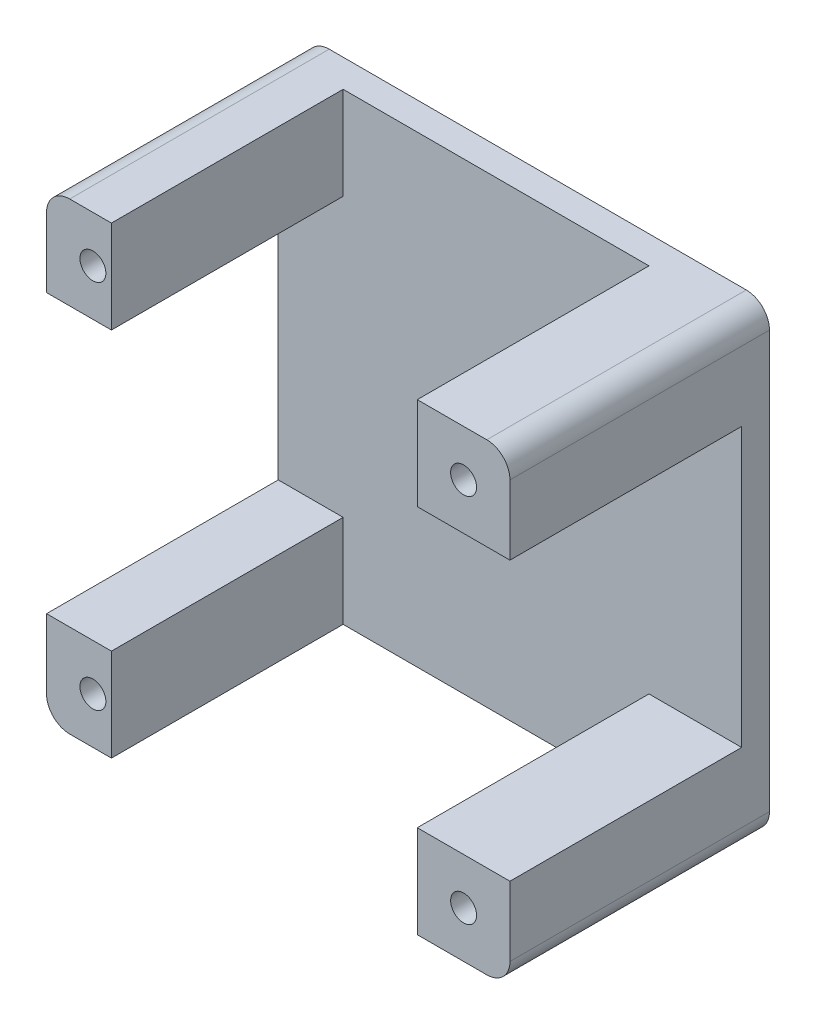
ISO-10303-21;
HEADER;
FILE_DESCRIPTION(('STEP AP214'),'2;1');
FILE_NAME('part.step','',(''),(''),'','','');
FILE_SCHEMA(('AUTOMOTIVE_DESIGN { 1 0 10303 214 1 1 1 1 }'));
ENDSEC;
DATA;
#1=APPLICATION_CONTEXT('core data for automotive mechanical design processes');
#2=APPLICATION_PROTOCOL_DEFINITION('international standard','automotive_design',2000,#1);
#3=PRODUCT_CONTEXT('',#1,'mechanical');
#4=PRODUCT('Part','Part','',(#3));
#5=PRODUCT_RELATED_PRODUCT_CATEGORY('part','',(#4));
#6=PRODUCT_DEFINITION_FORMATION('','',#4);
#7=PRODUCT_DEFINITION_CONTEXT('part definition',#1,'design');
#8=PRODUCT_DEFINITION('design','',#6,#7);
#9=PRODUCT_DEFINITION_SHAPE('','',#8);
#10=(LENGTH_UNIT() NAMED_UNIT(*) SI_UNIT(.MILLI.,.METRE.));
#11=(NAMED_UNIT(*) PLANE_ANGLE_UNIT() SI_UNIT($,.RADIAN.));
#12=(NAMED_UNIT(*) SI_UNIT($,.STERADIAN.) SOLID_ANGLE_UNIT());
#13=UNCERTAINTY_MEASURE_WITH_UNIT(LENGTH_MEASURE(1.E-05),#10,'distance_accuracy_value','');
#14=(GEOMETRIC_REPRESENTATION_CONTEXT(3) GLOBAL_UNCERTAINTY_ASSIGNED_CONTEXT((#13)) GLOBAL_UNIT_ASSIGNED_CONTEXT((#10,
#11,#12)) REPRESENTATION_CONTEXT('',''));
#15=CARTESIAN_POINT('',(0.,0.,0.));
#16=DIRECTION('',(0.,0.,1.));
#17=DIRECTION('',(1.,0.,0.));
#18=AXIS2_PLACEMENT_3D('',#15,#16,#17);
#19=CARTESIAN_POINT('',(25.0000003725295,0.,3.));
#20=DIRECTION('',(-1.,0.,0.));
#21=DIRECTION('',(0.,0.,1.));
#22=AXIS2_PLACEMENT_3D('',#19,#20,#21);
#23=PLANE('',#22);
#24=DIRECTION('',(0.,1.,0.));
#25=VECTOR('',#24,1.);
#26=CARTESIAN_POINT('',(25.0000003725295,0.,0.));
#27=LINE('',#26,#25);
#28=CARTESIAN_POINT('',(25.0000003725295,-22.5000003725286,0.));
#29=VERTEX_POINT('',#28);
#30=CARTESIAN_POINT('',(25.0000003725285,22.5000003725294,0.));
#31=VERTEX_POINT('',#30);
#32=EDGE_CURVE('E308',#29,#31,#27,.T.);
#33=ORIENTED_EDGE('',*,*,#32,.T.);
#34=DIRECTION('',(0.,0.,-1.));
#35=VECTOR('',#34,1.);
#36=CARTESIAN_POINT('',(25.0000003725285,22.5000003725294,28.));
#37=LINE('',#36,#35);
#38=CARTESIAN_POINT('',(25.0000003725285,22.5000003725294,28.));
#39=VERTEX_POINT('',#38);
#40=EDGE_CURVE('E236',#39,#31,#37,.T.);
#41=ORIENTED_EDGE('',*,*,#40,.F.);
#42=DIRECTION('',(0.,1.,0.));
#43=VECTOR('',#42,1.);
#44=CARTESIAN_POINT('',(25.0000003725291,6.70759720722475E-13,28.));
#45=LINE('',#44,#43);
#46=CARTESIAN_POINT('',(25.0000003725295,14.9999999999995,28.));
#47=VERTEX_POINT('',#46);
#48=EDGE_CURVE('E210',#47,#39,#45,.T.);
#49=ORIENTED_EDGE('',*,*,#48,.F.);
#50=DIRECTION('',(0.,0.,-1.));
#51=VECTOR('',#50,1.);
#52=CARTESIAN_POINT('',(25.0000003725295,14.9999999999995,28.));
#53=LINE('',#52,#51);
#54=CARTESIAN_POINT('',(25.0000003725295,14.9999999999995,3.));
#55=VERTEX_POINT('',#54);
#56=EDGE_CURVE('E221',#47,#55,#53,.T.);
#57=ORIENTED_EDGE('',*,*,#56,.T.);
#58=DIRECTION('',(0.,1.,0.));
#59=VECTOR('',#58,1.);
#60=CARTESIAN_POINT('',(25.0000003725295,0.,3.));
#61=LINE('',#60,#59);
#62=CARTESIAN_POINT('',(25.0000003725295,-15.0000000000005,3.));
#63=VERTEX_POINT('',#62);
#64=EDGE_CURVE('E314',#63,#55,#61,.T.);
#65=ORIENTED_EDGE('',*,*,#64,.F.);
#66=DIRECTION('',(0.,0.,-1.));
#67=VECTOR('',#66,1.);
#68=CARTESIAN_POINT('',(25.0000003725295,-15.0000000000005,28.));
#69=LINE('',#68,#67);
#70=CARTESIAN_POINT('',(25.0000003725295,-15.0000000000005,28.));
#71=VERTEX_POINT('',#70);
#72=EDGE_CURVE('E203',#71,#63,#69,.T.);
#73=ORIENTED_EDGE('',*,*,#72,.F.);
#74=DIRECTION('',(0.,1.,0.));
#75=VECTOR('',#74,1.);
#76=CARTESIAN_POINT('',(25.0000003725289,6.59194897951392E-13,28.));
#77=LINE('',#76,#75);
#78=CARTESIAN_POINT('',(25.0000003725295,-22.5000003725286,28.));
#79=VERTEX_POINT('',#78);
#80=EDGE_CURVE('E184',#79,#71,#77,.T.);
#81=ORIENTED_EDGE('',*,*,#80,.F.);
#82=DIRECTION('',(0.,0.,-1.));
#83=VECTOR('',#82,1.);
#84=CARTESIAN_POINT('',(25.0000003725295,-22.5000003725286,28.));
#85=LINE('',#84,#83);
#86=EDGE_CURVE('E181',#79,#29,#85,.T.);
#87=ORIENTED_EDGE('',*,*,#86,.T.);
#88=EDGE_LOOP('',(#33,#41,#49,#57,#65,#73,#81,#87));
#89=FACE_BOUND('',#88,.T.);
#90=ADVANCED_FACE('F36',(#89),#23,.F.);
#91=CARTESIAN_POINT('',(0.,25.0000003725285,3.));
#92=DIRECTION('',(0.,-1.,0.));
#93=DIRECTION('',(0.,0.,-1.));
#94=AXIS2_PLACEMENT_3D('',#91,#92,#93);
#95=PLANE('',#94);
#96=DIRECTION('',(-1.,0.,0.));
#97=VECTOR('',#96,1.);
#98=CARTESIAN_POINT('',(0.,25.0000003725285,0.));
#99=LINE('',#98,#97);
#100=CARTESIAN_POINT('',(22.5000003725285,25.0000003725294,0.));
#101=VERTEX_POINT('',#100);
#102=CARTESIAN_POINT('',(-22.5000003725296,25.0000003725284,0.));
#103=VERTEX_POINT('',#102);
#104=EDGE_CURVE('E333',#101,#103,#99,.T.);
#105=ORIENTED_EDGE('',*,*,#104,.T.);
#106=DIRECTION('',(0.,0.,-1.));
#107=VECTOR('',#106,1.);
#108=CARTESIAN_POINT('',(-22.5000003725296,25.0000003725284,28.));
#109=LINE('',#108,#107);
#110=CARTESIAN_POINT('',(-22.5000003725296,25.0000003725284,28.));
#111=VERTEX_POINT('',#110);
#112=EDGE_CURVE('E305',#111,#103,#109,.T.);
#113=ORIENTED_EDGE('',*,*,#112,.F.);
#114=DIRECTION('',(-1.,0.,0.));
#115=VECTOR('',#114,1.);
#116=CARTESIAN_POINT('',(0.,25.0000003725284,28.));
#117=LINE('',#116,#115);
#118=CARTESIAN_POINT('',(-18.0000000000003,25.0000003725284,28.));
#119=VERTEX_POINT('',#118);
#120=EDGE_CURVE('E278',#119,#111,#117,.T.);
#121=ORIENTED_EDGE('',*,*,#120,.F.);
#122=DIRECTION('',(0.,0.,-1.));
#123=VECTOR('',#122,1.);
#124=CARTESIAN_POINT('',(-18.0000000000003,25.0000003725284,28.));
#125=LINE('',#124,#123);
#126=CARTESIAN_POINT('',(-18.0000000000003,25.0000003725284,3.));
#127=VERTEX_POINT('',#126);
#128=EDGE_CURVE('E290',#119,#127,#125,.T.);
#129=ORIENTED_EDGE('',*,*,#128,.T.);
#130=DIRECTION('',(-1.,0.,0.));
#131=VECTOR('',#130,1.);
#132=CARTESIAN_POINT('',(0.,25.0000003725285,3.));
#133=LINE('',#132,#131);
#134=CARTESIAN_POINT('',(14.9999999999995,25.0000003725294,3.));
#135=VERTEX_POINT('',#134);
#136=EDGE_CURVE('E321',#135,#127,#133,.T.);
#137=ORIENTED_EDGE('',*,*,#136,.F.);
#138=DIRECTION('',(0.,0.,-1.));
#139=VECTOR('',#138,1.);
#140=CARTESIAN_POINT('',(14.9999999999995,25.0000003725294,28.));
#141=LINE('',#140,#139);
#142=CARTESIAN_POINT('',(14.9999999999995,25.0000003725294,28.));
#143=VERTEX_POINT('',#142);
#144=EDGE_CURVE('E230',#143,#135,#141,.T.);
#145=ORIENTED_EDGE('',*,*,#144,.F.);
#146=DIRECTION('',(-1.,0.,0.));
#147=VECTOR('',#146,1.);
#148=CARTESIAN_POINT('',(0.,25.0000003725294,28.));
#149=LINE('',#148,#147);
#150=CARTESIAN_POINT('',(22.5000003725285,25.0000003725294,28.));
#151=VERTEX_POINT('',#150);
#152=EDGE_CURVE('E215',#151,#143,#149,.T.);
#153=ORIENTED_EDGE('',*,*,#152,.F.);
#154=DIRECTION('',(0.,0.,-1.));
#155=VECTOR('',#154,1.);
#156=CARTESIAN_POINT('',(22.5000003725285,25.0000003725294,28.));
#157=LINE('',#156,#155);
#158=EDGE_CURVE('E233',#151,#101,#157,.T.);
#159=ORIENTED_EDGE('',*,*,#158,.T.);
#160=EDGE_LOOP('',(#105,#113,#121,#129,#137,#145,#153,#159));
#161=FACE_BOUND('',#160,.T.);
#162=ADVANCED_FACE('F395',(#161),#95,.F.);
#163=CARTESIAN_POINT('',(-25.00000037253,2.08166820219154E-12,3.));
#164=DIRECTION('',(1.,0.,0.));
#165=DIRECTION('',(0.,1.,0.));
#166=AXIS2_PLACEMENT_3D('',#163,#164,#165);
#167=PLANE('',#166);
#168=DIRECTION('',(0.,-1.,0.));
#169=VECTOR('',#168,1.);
#170=CARTESIAN_POINT('',(-25.00000037253,2.08166820219154E-12,0.));
#171=LINE('',#170,#169);
#172=CARTESIAN_POINT('',(-25.0000003725295,22.5000003725284,0.));
#173=VERTEX_POINT('',#172);
#174=CARTESIAN_POINT('',(-25.0000003725286,-22.5000003725296,0.));
#175=VERTEX_POINT('',#174);
#176=EDGE_CURVE('E334',#173,#175,#171,.T.);
#177=ORIENTED_EDGE('',*,*,#176,.T.);
#178=DIRECTION('',(0.,0.,-1.));
#179=VECTOR('',#178,1.);
#180=CARTESIAN_POINT('',(-25.0000003725286,-22.5000003725296,28.));
#181=LINE('',#180,#179);
#182=CARTESIAN_POINT('',(-25.0000003725286,-22.5000003725296,28.));
#183=VERTEX_POINT('',#182);
#184=EDGE_CURVE('E271',#183,#175,#181,.T.);
#185=ORIENTED_EDGE('',*,*,#184,.F.);
#186=DIRECTION('',(0.,-1.,0.));
#187=VECTOR('',#186,1.);
#188=CARTESIAN_POINT('',(-25.0000003725289,-3.70074328674466E-13,28.));
#189=LINE('',#188,#187);
#190=CARTESIAN_POINT('',(-25.0000003725287,-15.0000000000005,28.));
#191=VERTEX_POINT('',#190);
#192=EDGE_CURVE('E243',#191,#183,#189,.T.);
#193=ORIENTED_EDGE('',*,*,#192,.F.);
#194=DIRECTION('',(0.,0.,-1.));
#195=VECTOR('',#194,1.);
#196=CARTESIAN_POINT('',(-25.0000003725287,-15.0000000000005,28.));
#197=LINE('',#196,#195);
#198=CARTESIAN_POINT('',(-25.0000003725287,-15.0000000000005,3.));
#199=VERTEX_POINT('',#198);
#200=EDGE_CURVE('E256',#191,#199,#197,.T.);
#201=ORIENTED_EDGE('',*,*,#200,.T.);
#202=DIRECTION('',(0.,-1.,0.));
#203=VECTOR('',#202,1.);
#204=CARTESIAN_POINT('',(-25.00000037253,2.08166820219154E-12,3.));
#205=LINE('',#204,#203);
#206=CARTESIAN_POINT('',(-25.0000003725294,14.9999999999994,3.));
#207=VERTEX_POINT('',#206);
#208=EDGE_CURVE('E328',#207,#199,#205,.T.);
#209=ORIENTED_EDGE('',*,*,#208,.F.);
#210=DIRECTION('',(0.,0.,-1.));
#211=VECTOR('',#210,1.);
#212=CARTESIAN_POINT('',(-25.0000003725294,14.9999999999994,28.));
#213=LINE('',#212,#211);
#214=CARTESIAN_POINT('',(-25.0000003725294,14.9999999999994,28.));
#215=VERTEX_POINT('',#214);
#216=EDGE_CURVE('E300',#215,#207,#213,.T.);
#217=ORIENTED_EDGE('',*,*,#216,.F.);
#218=DIRECTION('',(0.,-1.,0.));
#219=VECTOR('',#218,1.);
#220=CARTESIAN_POINT('',(-25.0000003725292,-3.23815037590162E-13,28.));
#221=LINE('',#220,#219);
#222=CARTESIAN_POINT('',(-25.0000003725295,22.5000003725284,28.));
#223=VERTEX_POINT('',#222);
#224=EDGE_CURVE('E284',#223,#215,#221,.T.);
#225=ORIENTED_EDGE('',*,*,#224,.F.);
#226=DIRECTION('',(0.,0.,-1.));
#227=VECTOR('',#226,1.);
#228=CARTESIAN_POINT('',(-25.0000003725295,22.5000003725284,28.));
#229=LINE('',#228,#227);
#230=EDGE_CURVE('E302',#223,#173,#229,.T.);
#231=ORIENTED_EDGE('',*,*,#230,.T.);
#232=EDGE_LOOP('',(#177,#185,#193,#201,#209,#217,#225,#231));
#233=FACE_BOUND('',#232,.T.);
#234=ADVANCED_FACE('F338',(#233),#167,.F.);
#235=CARTESIAN_POINT('',(0.,-25.0000003725294,3.));
#236=DIRECTION('',(0.,1.,0.));
#237=DIRECTION('',(0.,0.,1.));
#238=AXIS2_PLACEMENT_3D('',#235,#236,#237);
#239=PLANE('',#238);
#240=DIRECTION('',(1.,0.,0.));
#241=VECTOR('',#240,1.);
#242=CARTESIAN_POINT('',(0.,-25.0000003725294,0.));
#243=LINE('',#242,#241);
#244=CARTESIAN_POINT('',(-22.5000003725285,-25.0000003725296,0.));
#245=VERTEX_POINT('',#244);
#246=CARTESIAN_POINT('',(22.5000003725295,-25.0000003725286,0.));
#247=VERTEX_POINT('',#246);
#248=EDGE_CURVE('E39',#245,#247,#243,.T.);
#249=ORIENTED_EDGE('',*,*,#248,.T.);
#250=DIRECTION('',(0.,0.,-1.));
#251=VECTOR('',#250,1.);
#252=CARTESIAN_POINT('',(22.5000003725295,-25.0000003725286,28.));
#253=LINE('',#252,#251);
#254=CARTESIAN_POINT('',(22.5000003725295,-25.0000003725286,28.));
#255=VERTEX_POINT('',#254);
#256=EDGE_CURVE('E179',#255,#247,#253,.T.);
#257=ORIENTED_EDGE('',*,*,#256,.F.);
#258=DIRECTION('',(1.,0.,0.));
#259=VECTOR('',#258,1.);
#260=CARTESIAN_POINT('',(0.,-25.0000003725286,28.));
#261=LINE('',#260,#259);
#262=CARTESIAN_POINT('',(15.0000000000005,-25.0000003725286,28.));
#263=VERTEX_POINT('',#262);
#264=EDGE_CURVE('E185',#263,#255,#261,.T.);
#265=ORIENTED_EDGE('',*,*,#264,.F.);
#266=DIRECTION('',(0.,0.,-1.));
#267=VECTOR('',#266,1.);
#268=CARTESIAN_POINT('',(15.0000000000005,-25.0000003725286,28.));
#269=LINE('',#268,#267);
#270=CARTESIAN_POINT('',(15.0000000000005,-25.0000003725286,3.));
#271=VERTEX_POINT('',#270);
#272=EDGE_CURVE('E368',#263,#271,#269,.T.);
#273=ORIENTED_EDGE('',*,*,#272,.T.);
#274=DIRECTION('',(1.,0.,0.));
#275=VECTOR('',#274,1.);
#276=CARTESIAN_POINT('',(0.,-25.0000003725294,3.));
#277=LINE('',#276,#275);
#278=CARTESIAN_POINT('',(-17.9999999999995,-25.0000003725296,3.));
#279=VERTEX_POINT('',#278);
#280=EDGE_CURVE('E11',#279,#271,#277,.T.);
#281=ORIENTED_EDGE('',*,*,#280,.F.);
#282=DIRECTION('',(0.,0.,-1.));
#283=VECTOR('',#282,1.);
#284=CARTESIAN_POINT('',(-17.9999999999995,-25.0000003725296,28.));
#285=LINE('',#284,#283);
#286=CARTESIAN_POINT('',(-17.9999999999995,-25.0000003725296,28.));
#287=VERTEX_POINT('',#286);
#288=EDGE_CURVE('E266',#287,#279,#285,.T.);
#289=ORIENTED_EDGE('',*,*,#288,.F.);
#290=DIRECTION('',(1.,0.,0.));
#291=VECTOR('',#290,1.);
#292=CARTESIAN_POINT('',(0.,-25.0000003725296,28.));
#293=LINE('',#292,#291);
#294=CARTESIAN_POINT('',(-22.5000003725285,-25.0000003725296,28.));
#295=VERTEX_POINT('',#294);
#296=EDGE_CURVE('E249',#295,#287,#293,.T.);
#297=ORIENTED_EDGE('',*,*,#296,.F.);
#298=DIRECTION('',(0.,0.,-1.));
#299=VECTOR('',#298,1.);
#300=CARTESIAN_POINT('',(-22.5000003725285,-25.0000003725296,28.));
#301=LINE('',#300,#299);
#302=EDGE_CURVE('E269',#295,#245,#301,.T.);
#303=ORIENTED_EDGE('',*,*,#302,.T.);
#304=EDGE_LOOP('',(#249,#257,#265,#273,#281,#289,#297,#303));
#305=FACE_BOUND('',#304,.T.);
#306=ADVANCED_FACE('F195',(#305),#239,.F.);
#307=CARTESIAN_POINT('',(0.,0.,3.));
#308=DIRECTION('',(0.,0.,1.));
#309=DIRECTION('',(1.,0.,0.));
#310=AXIS2_PLACEMENT_3D('',#307,#308,#309);
#311=PLANE('',#310);
#312=DIRECTION('',(0.,-1.,0.));
#313=VECTOR('',#312,1.);
#314=CARTESIAN_POINT('',(15.,3.0184187357548E-13,3.));
#315=LINE('',#314,#313);
#316=CARTESIAN_POINT('',(15.0000000000005,-15.0000000000005,3.));
#317=VERTEX_POINT('',#316);
#318=EDGE_CURVE('E309',#317,#271,#315,.T.);
#319=ORIENTED_EDGE('',*,*,#318,.F.);
#320=DIRECTION('',(1.,0.,0.));
#321=VECTOR('',#320,1.);
#322=CARTESIAN_POINT('',(0.,-15.0000000000005,3.));
#323=LINE('',#322,#321);
#324=EDGE_CURVE('E311',#317,#63,#323,.T.);
#325=ORIENTED_EDGE('',*,*,#324,.T.);
#326=ORIENTED_EDGE('',*,*,#64,.T.);
#327=DIRECTION('',(-1.,0.,0.));
#328=VECTOR('',#327,1.);
#329=CARTESIAN_POINT('',(0.,14.9999999999995,3.));
#330=LINE('',#329,#328);
#331=CARTESIAN_POINT('',(15.0000000000004,14.9999999999995,3.));
#332=VERTEX_POINT('',#331);
#333=EDGE_CURVE('E316',#55,#332,#330,.T.);
#334=ORIENTED_EDGE('',*,*,#333,.T.);
#335=DIRECTION('',(0.,-1.,0.));
#336=VECTOR('',#335,1.);
#337=CARTESIAN_POINT('',(15.0000000000004,0.,3.));
#338=LINE('',#337,#336);
#339=EDGE_CURVE('E318',#135,#332,#338,.T.);
#340=ORIENTED_EDGE('',*,*,#339,.F.);
#341=ORIENTED_EDGE('',*,*,#136,.T.);
#342=DIRECTION('',(0.,1.,0.));
#343=VECTOR('',#342,1.);
#344=CARTESIAN_POINT('',(-18.0000000000003,0.,3.));
#345=LINE('',#344,#343);
#346=CARTESIAN_POINT('',(-18.0000000000003,14.9999999999994,3.));
#347=VERTEX_POINT('',#346);
#348=EDGE_CURVE('E324',#347,#127,#345,.T.);
#349=ORIENTED_EDGE('',*,*,#348,.F.);
#350=DIRECTION('',(1.,0.,0.));
#351=VECTOR('',#350,1.);
#352=CARTESIAN_POINT('',(0.,14.9999999999994,3.));
#353=LINE('',#352,#351);
#354=EDGE_CURVE('E326',#207,#347,#353,.T.);
#355=ORIENTED_EDGE('',*,*,#354,.F.);
#356=ORIENTED_EDGE('',*,*,#208,.T.);
#357=DIRECTION('',(1.,0.,0.));
#358=VECTOR('',#357,1.);
#359=CARTESIAN_POINT('',(0.,-15.0000000000005,3.));
#360=LINE('',#359,#358);
#361=CARTESIAN_POINT('',(-17.9999999999997,-15.0000000000005,3.));
#362=VERTEX_POINT('',#361);
#363=EDGE_CURVE('E57',#199,#362,#360,.T.);
#364=ORIENTED_EDGE('',*,*,#363,.T.);
#365=DIRECTION('',(0.,1.,0.));
#366=VECTOR('',#365,1.);
#367=CARTESIAN_POINT('',(-18.,-3.33066907387545E-13,3.));
#368=LINE('',#367,#366);
#369=EDGE_CURVE('E44',#279,#362,#368,.T.);
#370=ORIENTED_EDGE('',*,*,#369,.F.);
#371=ORIENTED_EDGE('',*,*,#280,.T.);
#372=EDGE_LOOP('',(#319,#325,#326,#334,#340,#341,#349,#355,#356,#364,#370,#371));
#373=FACE_BOUND('',#372,.T.);
#374=ADVANCED_FACE('F363',(#373),#311,.T.);
#375=CARTESIAN_POINT('',(0.,0.,0.));
#376=DIRECTION('',(0.,0.,1.));
#377=DIRECTION('',(1.,0.,0.));
#378=AXIS2_PLACEMENT_3D('',#375,#376,#377);
#379=PLANE('',#378);
#380=ORIENTED_EDGE('',*,*,#32,.F.);
#381=CARTESIAN_POINT('',(22.5000003725295,-22.5000003725286,0.));
#382=DIRECTION('',(0.,0.,1.));
#383=DIRECTION('',(1.,0.,0.));
#384=AXIS2_PLACEMENT_3D('',#381,#382,#383);
#385=CIRCLE('',#384,2.5);
#386=EDGE_CURVE('E375',#247,#29,#385,.T.);
#387=ORIENTED_EDGE('',*,*,#386,.F.);
#388=ORIENTED_EDGE('',*,*,#248,.F.);
#389=CARTESIAN_POINT('',(-22.5000003725286,-22.5000003725296,0.));
#390=DIRECTION('',(0.,0.,1.));
#391=DIRECTION('',(1.,0.,0.));
#392=AXIS2_PLACEMENT_3D('',#389,#390,#391);
#393=CIRCLE('',#392,2.5);
#394=EDGE_CURVE('E244',#175,#245,#393,.T.);
#395=ORIENTED_EDGE('',*,*,#394,.F.);
#396=ORIENTED_EDGE('',*,*,#176,.F.);
#397=CARTESIAN_POINT('',(-22.5000003725295,22.5000003725284,0.));
#398=DIRECTION('',(0.,0.,1.));
#399=DIRECTION('',(1.,0.,0.));
#400=AXIS2_PLACEMENT_3D('',#397,#398,#399);
#401=CIRCLE('',#400,2.5);
#402=EDGE_CURVE('E279',#103,#173,#401,.T.);
#403=ORIENTED_EDGE('',*,*,#402,.F.);
#404=ORIENTED_EDGE('',*,*,#104,.F.);
#405=CARTESIAN_POINT('',(22.5000003725285,22.5000003725294,0.));
#406=DIRECTION('',(0.,0.,1.));
#407=DIRECTION('',(1.,0.,0.));
#408=AXIS2_PLACEMENT_3D('',#405,#406,#407);
#409=CIRCLE('',#408,2.5);
#410=EDGE_CURVE('E201',#31,#101,#409,.T.);
#411=ORIENTED_EDGE('',*,*,#410,.F.);
#412=EDGE_LOOP('',(#380,#387,#388,#395,#396,#403,#404,#411));
#413=FACE_BOUND('',#412,.T.);
#414=CARTESIAN_POINT('',(-20.0000000000004,19.9999999999994,0.));
#415=DIRECTION('',(0.,0.,1.));
#416=DIRECTION('',(1.,0.,0.));
#417=AXIS2_PLACEMENT_3D('',#414,#415,#416);
#418=CIRCLE('',#417,1.4);
#419=CARTESIAN_POINT('',(-18.6000000000004,19.9999999999994,0.));
#420=VERTEX_POINT('',#419);
#421=EDGE_CURVE('E274',#420,#420,#418,.T.);
#422=ORIENTED_EDGE('',*,*,#421,.T.);
#423=EDGE_LOOP('',(#422));
#424=FACE_BOUND('',#423,.T.);
#425=CARTESIAN_POINT('',(-19.9999999999996,-20.0000000000005,0.));
#426=DIRECTION('',(0.,0.,1.));
#427=DIRECTION('',(1.,0.,0.));
#428=AXIS2_PLACEMENT_3D('',#425,#426,#427);
#429=CIRCLE('',#428,1.40000000000003);
#430=CARTESIAN_POINT('',(-18.5999999999996,-20.0000000000005,0.));
#431=VERTEX_POINT('',#430);
#432=EDGE_CURVE('E239',#431,#431,#429,.T.);
#433=ORIENTED_EDGE('',*,*,#432,.T.);
#434=EDGE_LOOP('',(#433));
#435=FACE_BOUND('',#434,.T.);
#436=CARTESIAN_POINT('',(19.9999999999996,20.0000000000004,0.));
#437=DIRECTION('',(0.,0.,1.));
#438=DIRECTION('',(1.,0.,0.));
#439=AXIS2_PLACEMENT_3D('',#436,#437,#438);
#440=CIRCLE('',#439,1.4);
#441=CARTESIAN_POINT('',(21.3999999999996,20.0000000000004,0.));
#442=VERTEX_POINT('',#441);
#443=EDGE_CURVE('E198',#442,#442,#440,.T.);
#444=ORIENTED_EDGE('',*,*,#443,.T.);
#445=EDGE_LOOP('',(#444));
#446=FACE_BOUND('',#445,.T.);
#447=CARTESIAN_POINT('',(20.0000000000004,-19.9999999999995,0.));
#448=DIRECTION('',(0.,0.,1.));
#449=DIRECTION('',(1.,0.,0.));
#450=AXIS2_PLACEMENT_3D('',#447,#448,#449);
#451=CIRCLE('',#450,1.40000000000002);
#452=CARTESIAN_POINT('',(21.4000000000004,-19.9999999999995,0.));
#453=VERTEX_POINT('',#452);
#454=EDGE_CURVE('E418',#453,#453,#451,.T.);
#455=ORIENTED_EDGE('',*,*,#454,.T.);
#456=EDGE_LOOP('',(#455));
#457=FACE_BOUND('',#456,.T.);
#458=ADVANCED_FACE('F344',(#413,#424,#435,#446,#457),#379,.F.);
#459=CARTESIAN_POINT('',(-22.5000003725295,22.5000003725284,28.));
#460=DIRECTION('',(0.,0.,-1.));
#461=DIRECTION('',(-1.,0.,0.));
#462=AXIS2_PLACEMENT_3D('',#459,#460,#461);
#463=CYLINDRICAL_SURFACE('',#462,2.5);
#464=ORIENTED_EDGE('',*,*,#402,.T.);
#465=ORIENTED_EDGE('',*,*,#230,.F.);
#466=CARTESIAN_POINT('',(-22.5000003725295,22.5000003725284,28.));
#467=DIRECTION('',(0.,0.,1.));
#468=DIRECTION('',(1.,0.,0.));
#469=AXIS2_PLACEMENT_3D('',#466,#467,#468);
#470=CIRCLE('',#469,2.5);
#471=EDGE_CURVE('E282',#111,#223,#470,.T.);
#472=ORIENTED_EDGE('',*,*,#471,.F.);
#473=ORIENTED_EDGE('',*,*,#112,.T.);
#474=EDGE_LOOP('',(#464,#465,#472,#473));
#475=FACE_BOUND('',#474,.T.);
#476=ADVANCED_FACE('F410',(#475),#463,.T.);
#477=CARTESIAN_POINT('',(0.,14.9999999999994,28.));
#478=DIRECTION('',(0.,1.,0.));
#479=DIRECTION('',(0.,0.,1.));
#480=AXIS2_PLACEMENT_3D('',#477,#478,#479);
#481=PLANE('',#480);
#482=ORIENTED_EDGE('',*,*,#354,.T.);
#483=DIRECTION('',(0.,0.,-1.));
#484=VECTOR('',#483,1.);
#485=CARTESIAN_POINT('',(-18.0000000000003,14.9999999999994,28.));
#486=LINE('',#485,#484);
#487=CARTESIAN_POINT('',(-18.0000000000003,14.9999999999994,28.));
#488=VERTEX_POINT('',#487);
#489=EDGE_CURVE('E297',#488,#347,#486,.T.);
#490=ORIENTED_EDGE('',*,*,#489,.F.);
#491=DIRECTION('',(1.,0.,0.));
#492=VECTOR('',#491,1.);
#493=CARTESIAN_POINT('',(0.,14.9999999999994,28.));
#494=LINE('',#493,#492);
#495=EDGE_CURVE('E286',#215,#488,#494,.T.);
#496=ORIENTED_EDGE('',*,*,#495,.F.);
#497=ORIENTED_EDGE('',*,*,#216,.T.);
#498=EDGE_LOOP('',(#482,#490,#496,#497));
#499=FACE_BOUND('',#498,.T.);
#500=ADVANCED_FACE('F406',(#499),#481,.F.);
#501=CARTESIAN_POINT('',(-20.0000000000004,19.9999999999994,28.));
#502=DIRECTION('',(0.,0.,-1.));
#503=DIRECTION('',(-1.,0.,0.));
#504=AXIS2_PLACEMENT_3D('',#501,#502,#503);
#505=CYLINDRICAL_SURFACE('',#504,1.4);
#506=CARTESIAN_POINT('',(-20.0000000000004,19.9999999999994,28.));
#507=DIRECTION('',(0.,0.,1.));
#508=DIRECTION('',(1.,0.,0.));
#509=AXIS2_PLACEMENT_3D('',#506,#507,#508);
#510=CIRCLE('',#509,1.4);
#511=CARTESIAN_POINT('',(-18.6000000000004,19.9999999999994,28.));
#512=VERTEX_POINT('',#511);
#513=EDGE_CURVE('E275',#512,#512,#510,.T.);
#514=ORIENTED_EDGE('',*,*,#513,.T.);
#515=EDGE_LOOP('',(#514));
#516=FACE_BOUND('',#515,.T.);
#517=ORIENTED_EDGE('',*,*,#421,.F.);
#518=EDGE_LOOP('',(#517));
#519=FACE_BOUND('',#518,.T.);
#520=ADVANCED_FACE('F454',(#516,#519),#505,.F.);
#521=CARTESIAN_POINT('',(-18.0000000000003,0.,28.));
#522=DIRECTION('',(-1.,0.,0.));
#523=DIRECTION('',(0.,0.,1.));
#524=AXIS2_PLACEMENT_3D('',#521,#522,#523);
#525=PLANE('',#524);
#526=ORIENTED_EDGE('',*,*,#348,.T.);
#527=ORIENTED_EDGE('',*,*,#128,.F.);
#528=DIRECTION('',(0.,1.,0.));
#529=VECTOR('',#528,1.);
#530=CARTESIAN_POINT('',(-18.0000000000003,0.,28.));
#531=LINE('',#530,#529);
#532=EDGE_CURVE('E288',#488,#119,#531,.T.);
#533=ORIENTED_EDGE('',*,*,#532,.F.);
#534=ORIENTED_EDGE('',*,*,#489,.T.);
#535=EDGE_LOOP('',(#526,#527,#533,#534));
#536=FACE_BOUND('',#535,.T.);
#537=ADVANCED_FACE('F402',(#536),#525,.F.);
#538=CARTESIAN_POINT('',(0.,0.,28.));
#539=DIRECTION('',(0.,0.,1.));
#540=DIRECTION('',(1.,0.,0.));
#541=AXIS2_PLACEMENT_3D('',#538,#539,#540);
#542=PLANE('',#541);
#543=ORIENTED_EDGE('',*,*,#513,.F.);
#544=EDGE_LOOP('',(#543));
#545=FACE_BOUND('',#544,.T.);
#546=ORIENTED_EDGE('',*,*,#120,.T.);
#547=ORIENTED_EDGE('',*,*,#471,.T.);
#548=ORIENTED_EDGE('',*,*,#224,.T.);
#549=ORIENTED_EDGE('',*,*,#495,.T.);
#550=ORIENTED_EDGE('',*,*,#532,.T.);
#551=EDGE_LOOP('',(#546,#547,#548,#549,#550));
#552=FACE_BOUND('',#551,.T.);
#553=ADVANCED_FACE('F408',(#545,#552),#542,.T.);
#554=CARTESIAN_POINT('',(-22.5000003725286,-22.5000003725296,28.));
#555=DIRECTION('',(0.,0.,-1.));
#556=DIRECTION('',(-1.,0.,0.));
#557=AXIS2_PLACEMENT_3D('',#554,#555,#556);
#558=CYLINDRICAL_SURFACE('',#557,2.5);
#559=ORIENTED_EDGE('',*,*,#394,.T.);
#560=ORIENTED_EDGE('',*,*,#302,.F.);
#561=CARTESIAN_POINT('',(-22.5000003725286,-22.5000003725296,28.));
#562=DIRECTION('',(0.,0.,1.));
#563=DIRECTION('',(1.,0.,0.));
#564=AXIS2_PLACEMENT_3D('',#561,#562,#563);
#565=CIRCLE('',#564,2.5);
#566=EDGE_CURVE('E247',#183,#295,#565,.T.);
#567=ORIENTED_EDGE('',*,*,#566,.F.);
#568=ORIENTED_EDGE('',*,*,#184,.T.);
#569=EDGE_LOOP('',(#559,#560,#567,#568));
#570=FACE_BOUND('',#569,.T.);
#571=ADVANCED_FACE('F348',(#570),#558,.T.);
#572=CARTESIAN_POINT('',(-18.,-3.49720239728831E-13,28.));
#573=DIRECTION('',(-1.,0.,0.));
#574=DIRECTION('',(0.,-1.,0.));
#575=AXIS2_PLACEMENT_3D('',#572,#573,#574);
#576=PLANE('',#575);
#577=ORIENTED_EDGE('',*,*,#369,.T.);
#578=DIRECTION('',(0.,0.,-1.));
#579=VECTOR('',#578,1.);
#580=CARTESIAN_POINT('',(-17.9999999999997,-15.0000000000005,28.));
#581=LINE('',#580,#579);
#582=CARTESIAN_POINT('',(-17.9999999999997,-15.0000000000005,28.));
#583=VERTEX_POINT('',#582);
#584=EDGE_CURVE('E263',#583,#362,#581,.T.);
#585=ORIENTED_EDGE('',*,*,#584,.F.);
#586=DIRECTION('',(0.,1.,0.));
#587=VECTOR('',#586,1.);
#588=CARTESIAN_POINT('',(-18.,-3.49720239728831E-13,28.));
#589=LINE('',#588,#587);
#590=EDGE_CURVE('E251',#287,#583,#589,.T.);
#591=ORIENTED_EDGE('',*,*,#590,.F.);
#592=ORIENTED_EDGE('',*,*,#288,.T.);
#593=EDGE_LOOP('',(#577,#585,#591,#592));
#594=FACE_BOUND('',#593,.T.);
#595=ADVANCED_FACE('F361',(#594),#576,.F.);
#596=CARTESIAN_POINT('',(-19.9999999999996,-20.0000000000005,28.));
#597=DIRECTION('',(0.,0.,-1.));
#598=DIRECTION('',(-1.,0.,0.));
#599=AXIS2_PLACEMENT_3D('',#596,#597,#598);
#600=CYLINDRICAL_SURFACE('',#599,1.40000000000003);
#601=CARTESIAN_POINT('',(-19.9999999999996,-20.0000000000005,28.));
#602=DIRECTION('',(0.,0.,1.));
#603=DIRECTION('',(1.,0.,0.));
#604=AXIS2_PLACEMENT_3D('',#601,#602,#603);
#605=CIRCLE('',#604,1.40000000000003);
#606=CARTESIAN_POINT('',(-18.5999999999996,-20.0000000000005,28.));
#607=VERTEX_POINT('',#606);
#608=EDGE_CURVE('E240',#607,#607,#605,.T.);
#609=ORIENTED_EDGE('',*,*,#608,.T.);
#610=EDGE_LOOP('',(#609));
#611=FACE_BOUND('',#610,.T.);
#612=ORIENTED_EDGE('',*,*,#432,.F.);
#613=EDGE_LOOP('',(#612));
#614=FACE_BOUND('',#613,.T.);
#615=ADVANCED_FACE('F467',(#611,#614),#600,.F.);
#616=CARTESIAN_POINT('',(0.,-15.0000000000005,28.));
#617=DIRECTION('',(0.,1.,0.));
#618=DIRECTION('',(0.,0.,1.));
#619=AXIS2_PLACEMENT_3D('',#616,#617,#618);
#620=PLANE('',#619);
#621=ORIENTED_EDGE('',*,*,#584,.T.);
#622=ORIENTED_EDGE('',*,*,#363,.F.);
#623=ORIENTED_EDGE('',*,*,#200,.F.);
#624=DIRECTION('',(1.,0.,0.));
#625=VECTOR('',#624,1.);
#626=CARTESIAN_POINT('',(0.,-15.0000000000005,28.));
#627=LINE('',#626,#625);
#628=EDGE_CURVE('E253',#191,#583,#627,.T.);
#629=ORIENTED_EDGE('',*,*,#628,.T.);
#630=EDGE_LOOP('',(#621,#622,#623,#629));
#631=FACE_BOUND('',#630,.T.);
#632=ADVANCED_FACE('F357',(#631),#620,.T.);
#633=CARTESIAN_POINT('',(0.,0.,28.));
#634=DIRECTION('',(0.,0.,1.));
#635=DIRECTION('',(1.,0.,0.));
#636=AXIS2_PLACEMENT_3D('',#633,#634,#635);
#637=PLANE('',#636);
#638=ORIENTED_EDGE('',*,*,#608,.F.);
#639=EDGE_LOOP('',(#638));
#640=FACE_BOUND('',#639,.T.);
#641=ORIENTED_EDGE('',*,*,#192,.T.);
#642=ORIENTED_EDGE('',*,*,#566,.T.);
#643=ORIENTED_EDGE('',*,*,#296,.T.);
#644=ORIENTED_EDGE('',*,*,#590,.T.);
#645=ORIENTED_EDGE('',*,*,#628,.F.);
#646=EDGE_LOOP('',(#641,#642,#643,#644,#645));
#647=FACE_BOUND('',#646,.T.);
#648=ADVANCED_FACE('F352',(#640,#647),#637,.T.);
#649=CARTESIAN_POINT('',(22.5000003725285,22.5000003725294,28.));
#650=DIRECTION('',(0.,0.,-1.));
#651=DIRECTION('',(-1.,0.,0.));
#652=AXIS2_PLACEMENT_3D('',#649,#650,#651);
#653=CYLINDRICAL_SURFACE('',#652,2.5);
#654=ORIENTED_EDGE('',*,*,#410,.T.);
#655=ORIENTED_EDGE('',*,*,#158,.F.);
#656=CARTESIAN_POINT('',(22.5000003725285,22.5000003725294,28.));
#657=DIRECTION('',(0.,0.,1.));
#658=DIRECTION('',(1.,0.,0.));
#659=AXIS2_PLACEMENT_3D('',#656,#657,#658);
#660=CIRCLE('',#659,2.5);
#661=EDGE_CURVE('E213',#39,#151,#660,.T.);
#662=ORIENTED_EDGE('',*,*,#661,.F.);
#663=ORIENTED_EDGE('',*,*,#40,.T.);
#664=EDGE_LOOP('',(#654,#655,#662,#663));
#665=FACE_BOUND('',#664,.T.);
#666=ADVANCED_FACE('F414',(#665),#653,.T.);
#667=CARTESIAN_POINT('',(15.,3.0184187357548E-13,28.));
#668=DIRECTION('',(1.,0.,0.));
#669=DIRECTION('',(0.,1.,0.));
#670=AXIS2_PLACEMENT_3D('',#667,#668,#669);
#671=PLANE('',#670);
#672=ORIENTED_EDGE('',*,*,#339,.T.);
#673=DIRECTION('',(0.,0.,-1.));
#674=VECTOR('',#673,1.);
#675=CARTESIAN_POINT('',(15.0000000000004,14.9999999999995,28.));
#676=LINE('',#675,#674);
#677=CARTESIAN_POINT('',(15.0000000000004,14.9999999999995,28.));
#678=VERTEX_POINT('',#677);
#679=EDGE_CURVE('E227',#678,#332,#676,.T.);
#680=ORIENTED_EDGE('',*,*,#679,.F.);
#681=DIRECTION('',(0.,-1.,0.));
#682=VECTOR('',#681,1.);
#683=CARTESIAN_POINT('',(15.,3.0184187357548E-13,28.));
#684=LINE('',#683,#682);
#685=EDGE_CURVE('E217',#143,#678,#684,.T.);
#686=ORIENTED_EDGE('',*,*,#685,.F.);
#687=ORIENTED_EDGE('',*,*,#144,.T.);
#688=EDGE_LOOP('',(#672,#680,#686,#687));
#689=FACE_BOUND('',#688,.T.);
#690=ADVANCED_FACE('F391',(#689),#671,.F.);
#691=CARTESIAN_POINT('',(19.9999999999996,20.0000000000004,28.));
#692=DIRECTION('',(0.,0.,-1.));
#693=DIRECTION('',(-1.,0.,0.));
#694=AXIS2_PLACEMENT_3D('',#691,#692,#693);
#695=CYLINDRICAL_SURFACE('',#694,1.4);
#696=CARTESIAN_POINT('',(19.9999999999996,20.0000000000004,28.));
#697=DIRECTION('',(0.,0.,1.));
#698=DIRECTION('',(1.,0.,0.));
#699=AXIS2_PLACEMENT_3D('',#696,#697,#698);
#700=CIRCLE('',#699,1.4);
#701=CARTESIAN_POINT('',(21.3999999999996,20.0000000000004,28.));
#702=VERTEX_POINT('',#701);
#703=EDGE_CURVE('E207',#702,#702,#700,.T.);
#704=ORIENTED_EDGE('',*,*,#703,.T.);
#705=EDGE_LOOP('',(#704));
#706=FACE_BOUND('',#705,.T.);
#707=ORIENTED_EDGE('',*,*,#443,.F.);
#708=EDGE_LOOP('',(#707));
#709=FACE_BOUND('',#708,.T.);
#710=ADVANCED_FACE('F480',(#706,#709),#695,.F.);
#711=CARTESIAN_POINT('',(0.,14.9999999999995,28.));
#712=DIRECTION('',(0.,-1.,0.));
#713=DIRECTION('',(0.,0.,-1.));
#714=AXIS2_PLACEMENT_3D('',#711,#712,#713);
#715=PLANE('',#714);
#716=ORIENTED_EDGE('',*,*,#679,.T.);
#717=ORIENTED_EDGE('',*,*,#333,.F.);
#718=ORIENTED_EDGE('',*,*,#56,.F.);
#719=DIRECTION('',(-1.,0.,0.));
#720=VECTOR('',#719,1.);
#721=CARTESIAN_POINT('',(0.,14.9999999999995,28.));
#722=LINE('',#721,#720);
#723=EDGE_CURVE('E219',#47,#678,#722,.T.);
#724=ORIENTED_EDGE('',*,*,#723,.T.);
#725=EDGE_LOOP('',(#716,#717,#718,#724));
#726=FACE_BOUND('',#725,.T.);
#727=ADVANCED_FACE('F386',(#726),#715,.T.);
#728=CARTESIAN_POINT('',(0.,0.,28.));
#729=DIRECTION('',(0.,0.,1.));
#730=DIRECTION('',(1.,0.,0.));
#731=AXIS2_PLACEMENT_3D('',#728,#729,#730);
#732=PLANE('',#731);
#733=ORIENTED_EDGE('',*,*,#703,.F.);
#734=EDGE_LOOP('',(#733));
#735=FACE_BOUND('',#734,.T.);
#736=ORIENTED_EDGE('',*,*,#48,.T.);
#737=ORIENTED_EDGE('',*,*,#661,.T.);
#738=ORIENTED_EDGE('',*,*,#152,.T.);
#739=ORIENTED_EDGE('',*,*,#685,.T.);
#740=ORIENTED_EDGE('',*,*,#723,.F.);
#741=EDGE_LOOP('',(#736,#737,#738,#739,#740));
#742=FACE_BOUND('',#741,.T.);
#743=ADVANCED_FACE('F417',(#735,#742),#732,.T.);
#744=CARTESIAN_POINT('',(22.5000003725295,-22.5000003725286,28.));
#745=DIRECTION('',(0.,0.,-1.));
#746=DIRECTION('',(-1.,0.,0.));
#747=AXIS2_PLACEMENT_3D('',#744,#745,#746);
#748=CYLINDRICAL_SURFACE('',#747,2.5);
#749=ORIENTED_EDGE('',*,*,#386,.T.);
#750=ORIENTED_EDGE('',*,*,#86,.F.);
#751=CARTESIAN_POINT('',(22.5000003725295,-22.5000003725286,28.));
#752=DIRECTION('',(0.,0.,1.));
#753=DIRECTION('',(1.,0.,0.));
#754=AXIS2_PLACEMENT_3D('',#751,#752,#753);
#755=CIRCLE('',#754,2.5);
#756=EDGE_CURVE('E174',#255,#79,#755,.T.);
#757=ORIENTED_EDGE('',*,*,#756,.F.);
#758=ORIENTED_EDGE('',*,*,#256,.T.);
#759=EDGE_LOOP('',(#749,#750,#757,#758));
#760=FACE_BOUND('',#759,.T.);
#761=ADVANCED_FACE('F177',(#760),#748,.T.);
#762=CARTESIAN_POINT('',(0.,-15.0000000000005,28.));
#763=DIRECTION('',(0.,1.,0.));
#764=DIRECTION('',(0.,0.,1.));
#765=AXIS2_PLACEMENT_3D('',#762,#763,#764);
#766=PLANE('',#765);
#767=ORIENTED_EDGE('',*,*,#72,.T.);
#768=ORIENTED_EDGE('',*,*,#324,.F.);
#769=DIRECTION('',(0.,0.,-1.));
#770=VECTOR('',#769,1.);
#771=CARTESIAN_POINT('',(15.0000000000005,-15.0000000000005,28.));
#772=LINE('',#771,#770);
#773=CARTESIAN_POINT('',(15.0000000000005,-15.0000000000005,28.));
#774=VERTEX_POINT('',#773);
#775=EDGE_CURVE('E369',#774,#317,#772,.T.);
#776=ORIENTED_EDGE('',*,*,#775,.F.);
#777=DIRECTION('',(1.,0.,0.));
#778=VECTOR('',#777,1.);
#779=CARTESIAN_POINT('',(0.,-15.0000000000005,28.));
#780=LINE('',#779,#778);
#781=EDGE_CURVE('E372',#774,#71,#780,.T.);
#782=ORIENTED_EDGE('',*,*,#781,.T.);
#783=EDGE_LOOP('',(#767,#768,#776,#782));
#784=FACE_BOUND('',#783,.T.);
#785=ADVANCED_FACE('F380',(#784),#766,.T.);
#786=CARTESIAN_POINT('',(20.0000000000004,-19.9999999999995,28.));
#787=DIRECTION('',(0.,0.,-1.));
#788=DIRECTION('',(-1.,0.,0.));
#789=AXIS2_PLACEMENT_3D('',#786,#787,#788);
#790=CYLINDRICAL_SURFACE('',#789,1.40000000000002);
#791=CARTESIAN_POINT('',(20.0000000000004,-19.9999999999995,28.));
#792=DIRECTION('',(0.,0.,1.));
#793=DIRECTION('',(1.,0.,0.));
#794=AXIS2_PLACEMENT_3D('',#791,#792,#793);
#795=CIRCLE('',#794,1.40000000000002);
#796=CARTESIAN_POINT('',(21.4000000000004,-19.9999999999995,28.));
#797=VERTEX_POINT('',#796);
#798=EDGE_CURVE('E193',#797,#797,#795,.T.);
#799=ORIENTED_EDGE('',*,*,#798,.T.);
#800=EDGE_LOOP('',(#799));
#801=FACE_BOUND('',#800,.T.);
#802=ORIENTED_EDGE('',*,*,#454,.F.);
#803=EDGE_LOOP('',(#802));
#804=FACE_BOUND('',#803,.T.);
#805=ADVANCED_FACE('F427',(#801,#804),#790,.F.);
#806=CARTESIAN_POINT('',(15.,3.0184187357548E-13,28.));
#807=DIRECTION('',(1.,0.,0.));
#808=DIRECTION('',(0.,1.,0.));
#809=AXIS2_PLACEMENT_3D('',#806,#807,#808);
#810=PLANE('',#809);
#811=ORIENTED_EDGE('',*,*,#318,.T.);
#812=ORIENTED_EDGE('',*,*,#272,.F.);
#813=DIRECTION('',(0.,-1.,0.));
#814=VECTOR('',#813,1.);
#815=CARTESIAN_POINT('',(15.,3.0184187357548E-13,28.));
#816=LINE('',#815,#814);
#817=EDGE_CURVE('E191',#774,#263,#816,.T.);
#818=ORIENTED_EDGE('',*,*,#817,.F.);
#819=ORIENTED_EDGE('',*,*,#775,.T.);
#820=EDGE_LOOP('',(#811,#812,#818,#819));
#821=FACE_BOUND('',#820,.T.);
#822=ADVANCED_FACE('F367',(#821),#810,.F.);
#823=CARTESIAN_POINT('',(0.,0.,28.));
#824=DIRECTION('',(0.,0.,1.));
#825=DIRECTION('',(1.,0.,0.));
#826=AXIS2_PLACEMENT_3D('',#823,#824,#825);
#827=PLANE('',#826);
#828=ORIENTED_EDGE('',*,*,#798,.F.);
#829=EDGE_LOOP('',(#828));
#830=FACE_BOUND('',#829,.T.);
#831=ORIENTED_EDGE('',*,*,#264,.T.);
#832=ORIENTED_EDGE('',*,*,#756,.T.);
#833=ORIENTED_EDGE('',*,*,#80,.T.);
#834=ORIENTED_EDGE('',*,*,#781,.F.);
#835=ORIENTED_EDGE('',*,*,#817,.T.);
#836=EDGE_LOOP('',(#831,#832,#833,#834,#835));
#837=FACE_BOUND('',#836,.T.);
#838=ADVANCED_FACE('F188',(#830,#837),#827,.T.);
#839=CLOSED_SHELL('',(#90,#162,#234,#306,#374,#458,#476,#500,#520,#537,#553,#571,#595,#615,#632,
#648,#666,#690,#710,#727,#743,#761,#785,#805,#822,#838));
#840=MANIFOLD_SOLID_BREP('B2',#839);
#841=ADVANCED_BREP_SHAPE_REPRESENTATION('',(#18,#840),#14);
#842=SHAPE_DEFINITION_REPRESENTATION(#9,#841);
ENDSEC;
END-ISO-10303-21;
